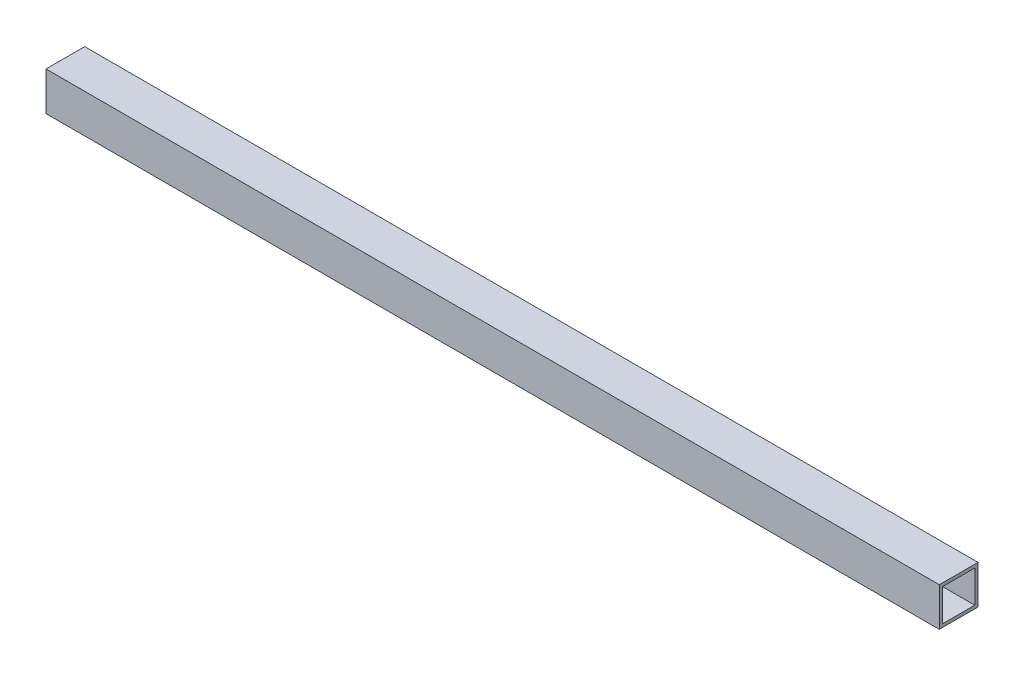
ISO-10303-21;
HEADER;
FILE_DESCRIPTION(('STEP AP214'),'2;1');
FILE_NAME('part.step','',(''),(''),'','','');
FILE_SCHEMA(('AUTOMOTIVE_DESIGN { 1 0 10303 214 1 1 1 1 }'));
ENDSEC;
DATA;
#1=APPLICATION_CONTEXT('core data for automotive mechanical design processes');
#2=APPLICATION_PROTOCOL_DEFINITION('international standard','automotive_design',2000,#1);
#3=PRODUCT_CONTEXT('',#1,'mechanical');
#4=PRODUCT('Part','Part','',(#3));
#5=PRODUCT_RELATED_PRODUCT_CATEGORY('part','',(#4));
#6=PRODUCT_DEFINITION_FORMATION('','',#4);
#7=PRODUCT_DEFINITION_CONTEXT('part definition',#1,'design');
#8=PRODUCT_DEFINITION('design','',#6,#7);
#9=PRODUCT_DEFINITION_SHAPE('','',#8);
#10=(LENGTH_UNIT() NAMED_UNIT(*) SI_UNIT(.MILLI.,.METRE.));
#11=(NAMED_UNIT(*) PLANE_ANGLE_UNIT() SI_UNIT($,.RADIAN.));
#12=(NAMED_UNIT(*) SI_UNIT($,.STERADIAN.) SOLID_ANGLE_UNIT());
#13=UNCERTAINTY_MEASURE_WITH_UNIT(LENGTH_MEASURE(1.E-05),#10,'distance_accuracy_value','');
#14=(GEOMETRIC_REPRESENTATION_CONTEXT(3) GLOBAL_UNCERTAINTY_ASSIGNED_CONTEXT((#13)) GLOBAL_UNIT_ASSIGNED_CONTEXT((#10,
#11,#12)) REPRESENTATION_CONTEXT('',''));
#15=CARTESIAN_POINT('',(0.,0.,0.));
#16=DIRECTION('',(0.,0.,1.));
#17=DIRECTION('',(1.,0.,0.));
#18=AXIS2_PLACEMENT_3D('',#15,#16,#17);
#19=CARTESIAN_POINT('',(440.,0.,0.));
#20=DIRECTION('',(-1.,0.,0.));
#21=DIRECTION('',(0.,0.,1.));
#22=AXIS2_PLACEMENT_3D('',#19,#20,#21);
#23=PLANE('',#22);
#24=DIRECTION('',(0.,1.,0.));
#25=VECTOR('',#24,1.);
#26=CARTESIAN_POINT('',(440.,9.525,-9.525));
#27=LINE('',#26,#25);
#28=CARTESIAN_POINT('',(440.,-9.525,-9.525));
#29=VERTEX_POINT('',#28);
#30=CARTESIAN_POINT('',(440.,9.525,-9.525));
#31=VERTEX_POINT('',#30);
#32=EDGE_CURVE('E153',#29,#31,#27,.T.);
#33=ORIENTED_EDGE('',*,*,#32,.T.);
#34=DIRECTION('',(0.,0.,1.));
#35=VECTOR('',#34,1.);
#36=CARTESIAN_POINT('',(440.,9.525,-9.525));
#37=LINE('',#36,#35);
#38=CARTESIAN_POINT('',(440.,9.525,9.525));
#39=VERTEX_POINT('',#38);
#40=EDGE_CURVE('E157',#31,#39,#37,.T.);
#41=ORIENTED_EDGE('',*,*,#40,.T.);
#42=DIRECTION('',(0.,-1.,0.));
#43=VECTOR('',#42,1.);
#44=CARTESIAN_POINT('',(440.,9.525,9.525));
#45=LINE('',#44,#43);
#46=CARTESIAN_POINT('',(440.,-9.525,9.525));
#47=VERTEX_POINT('',#46);
#48=EDGE_CURVE('E161',#39,#47,#45,.T.);
#49=ORIENTED_EDGE('',*,*,#48,.T.);
#50=DIRECTION('',(0.,0.,-1.));
#51=VECTOR('',#50,1.);
#52=CARTESIAN_POINT('',(440.,-9.525,-9.525));
#53=LINE('',#52,#51);
#54=EDGE_CURVE('E164',#47,#29,#53,.T.);
#55=ORIENTED_EDGE('',*,*,#54,.T.);
#56=EDGE_LOOP('',(#33,#41,#49,#55));
#57=FACE_BOUND('',#56,.T.);
#58=DIRECTION('',(0.,0.,-1.));
#59=VECTOR('',#58,1.);
#60=CARTESIAN_POINT('',(440.,-7.93750000000002,-7.93750000000001));
#61=LINE('',#60,#59);
#62=CARTESIAN_POINT('',(440.,-7.93750000000002,7.93750000000002));
#63=VERTEX_POINT('',#62);
#64=CARTESIAN_POINT('',(440.,-7.93750000000002,-7.93750000000001));
#65=VERTEX_POINT('',#64);
#66=EDGE_CURVE('E105',#63,#65,#61,.T.);
#67=ORIENTED_EDGE('',*,*,#66,.F.);
#68=DIRECTION('',(0.,-1.,0.));
#69=VECTOR('',#68,1.);
#70=CARTESIAN_POINT('',(440.,-7.93750000000002,7.93750000000002));
#71=LINE('',#70,#69);
#72=CARTESIAN_POINT('',(440.,7.9375,7.93750000000002));
#73=VERTEX_POINT('',#72);
#74=EDGE_CURVE('E131',#73,#63,#71,.T.);
#75=ORIENTED_EDGE('',*,*,#74,.F.);
#76=DIRECTION('',(0.,0.,1.));
#77=VECTOR('',#76,1.);
#78=CARTESIAN_POINT('',(440.,7.9375,-7.93750000000001));
#79=LINE('',#78,#77);
#80=CARTESIAN_POINT('',(440.,7.9375,-7.93750000000001));
#81=VERTEX_POINT('',#80);
#82=EDGE_CURVE('E127',#81,#73,#79,.T.);
#83=ORIENTED_EDGE('',*,*,#82,.F.);
#84=DIRECTION('',(0.,1.,0.));
#85=VECTOR('',#84,1.);
#86=CARTESIAN_POINT('',(440.,-7.93750000000002,-7.93750000000001));
#87=LINE('',#86,#85);
#88=EDGE_CURVE('E114',#65,#81,#87,.T.);
#89=ORIENTED_EDGE('',*,*,#88,.F.);
#90=EDGE_LOOP('',(#67,#75,#83,#89));
#91=FACE_BOUND('',#90,.T.);
#92=ADVANCED_FACE('F39',(#57,#91),#23,.F.);
#93=CARTESIAN_POINT('',(0.,0.,0.));
#94=DIRECTION('',(-1.,0.,0.));
#95=DIRECTION('',(0.,0.,1.));
#96=AXIS2_PLACEMENT_3D('',#93,#94,#95);
#97=PLANE('',#96);
#98=DIRECTION('',(0.,1.,0.));
#99=VECTOR('',#98,1.);
#100=CARTESIAN_POINT('',(0.,9.525,-9.525));
#101=LINE('',#100,#99);
#102=CARTESIAN_POINT('',(0.,-9.525,-9.525));
#103=VERTEX_POINT('',#102);
#104=CARTESIAN_POINT('',(0.,9.525,-9.525));
#105=VERTEX_POINT('',#104);
#106=EDGE_CURVE('E123',#103,#105,#101,.T.);
#107=ORIENTED_EDGE('',*,*,#106,.F.);
#108=DIRECTION('',(0.,0.,-1.));
#109=VECTOR('',#108,1.);
#110=CARTESIAN_POINT('',(0.,-9.525,-9.525));
#111=LINE('',#110,#109);
#112=CARTESIAN_POINT('',(0.,-9.525,9.525));
#113=VERTEX_POINT('',#112);
#114=EDGE_CURVE('E158',#113,#103,#111,.T.);
#115=ORIENTED_EDGE('',*,*,#114,.F.);
#116=DIRECTION('',(0.,-1.,0.));
#117=VECTOR('',#116,1.);
#118=CARTESIAN_POINT('',(0.,9.525,9.525));
#119=LINE('',#118,#117);
#120=CARTESIAN_POINT('',(0.,9.525,9.525));
#121=VERTEX_POINT('',#120);
#122=EDGE_CURVE('E174',#121,#113,#119,.T.);
#123=ORIENTED_EDGE('',*,*,#122,.F.);
#124=DIRECTION('',(0.,0.,1.));
#125=VECTOR('',#124,1.);
#126=CARTESIAN_POINT('',(0.,9.525,-9.525));
#127=LINE('',#126,#125);
#128=EDGE_CURVE('E171',#105,#121,#127,.T.);
#129=ORIENTED_EDGE('',*,*,#128,.F.);
#130=EDGE_LOOP('',(#107,#115,#123,#129));
#131=FACE_BOUND('',#130,.T.);
#132=DIRECTION('',(0.,-1.,0.));
#133=VECTOR('',#132,1.);
#134=CARTESIAN_POINT('',(0.,-7.93750000000002,7.93750000000002));
#135=LINE('',#134,#133);
#136=CARTESIAN_POINT('',(0.,7.9375,7.93750000000002));
#137=VERTEX_POINT('',#136);
#138=CARTESIAN_POINT('',(0.,-7.93750000000002,7.93750000000002));
#139=VERTEX_POINT('',#138);
#140=EDGE_CURVE('E115',#137,#139,#135,.T.);
#141=ORIENTED_EDGE('',*,*,#140,.T.);
#142=DIRECTION('',(0.,0.,-1.));
#143=VECTOR('',#142,1.);
#144=CARTESIAN_POINT('',(0.,-7.93750000000002,-7.93750000000001));
#145=LINE('',#144,#143);
#146=CARTESIAN_POINT('',(0.,-7.93750000000002,-7.93750000000001));
#147=VERTEX_POINT('',#146);
#148=EDGE_CURVE('E63',#139,#147,#145,.T.);
#149=ORIENTED_EDGE('',*,*,#148,.T.);
#150=DIRECTION('',(0.,1.,0.));
#151=VECTOR('',#150,1.);
#152=CARTESIAN_POINT('',(0.,-7.93750000000002,-7.93750000000001));
#153=LINE('',#152,#151);
#154=CARTESIAN_POINT('',(0.,7.9375,-7.93750000000001));
#155=VERTEX_POINT('',#154);
#156=EDGE_CURVE('E121',#147,#155,#153,.T.);
#157=ORIENTED_EDGE('',*,*,#156,.T.);
#158=DIRECTION('',(0.,0.,1.));
#159=VECTOR('',#158,1.);
#160=CARTESIAN_POINT('',(0.,7.9375,-7.93750000000001));
#161=LINE('',#160,#159);
#162=EDGE_CURVE('E140',#155,#137,#161,.T.);
#163=ORIENTED_EDGE('',*,*,#162,.T.);
#164=EDGE_LOOP('',(#141,#149,#157,#163));
#165=FACE_BOUND('',#164,.T.);
#166=ADVANCED_FACE('F197',(#131,#165),#97,.T.);
#167=CARTESIAN_POINT('',(440.,9.525,-9.525));
#168=DIRECTION('',(0.,0.,1.));
#169=DIRECTION('',(0.,-1.,0.));
#170=AXIS2_PLACEMENT_3D('',#167,#168,#169);
#171=PLANE('',#170);
#172=ORIENTED_EDGE('',*,*,#106,.T.);
#173=DIRECTION('',(-1.,0.,0.));
#174=VECTOR('',#173,1.);
#175=CARTESIAN_POINT('',(440.,9.525,-9.525));
#176=LINE('',#175,#174);
#177=EDGE_CURVE('E11',#31,#105,#176,.T.);
#178=ORIENTED_EDGE('',*,*,#177,.F.);
#179=ORIENTED_EDGE('',*,*,#32,.F.);
#180=DIRECTION('',(-1.,0.,0.));
#181=VECTOR('',#180,1.);
#182=CARTESIAN_POINT('',(440.,-9.525,-9.525));
#183=LINE('',#182,#181);
#184=EDGE_CURVE('E167',#29,#103,#183,.T.);
#185=ORIENTED_EDGE('',*,*,#184,.T.);
#186=EDGE_LOOP('',(#172,#178,#179,#185));
#187=FACE_BOUND('',#186,.T.);
#188=ADVANCED_FACE('F41',(#187),#171,.F.);
#189=CARTESIAN_POINT('',(440.,9.525,-9.525));
#190=DIRECTION('',(0.,-1.,0.));
#191=DIRECTION('',(0.,0.,-1.));
#192=AXIS2_PLACEMENT_3D('',#189,#190,#191);
#193=PLANE('',#192);
#194=ORIENTED_EDGE('',*,*,#128,.T.);
#195=DIRECTION('',(-1.,0.,0.));
#196=VECTOR('',#195,1.);
#197=CARTESIAN_POINT('',(440.,9.525,9.525));
#198=LINE('',#197,#196);
#199=EDGE_CURVE('E48',#39,#121,#198,.T.);
#200=ORIENTED_EDGE('',*,*,#199,.F.);
#201=ORIENTED_EDGE('',*,*,#40,.F.);
#202=ORIENTED_EDGE('',*,*,#177,.T.);
#203=EDGE_LOOP('',(#194,#200,#201,#202));
#204=FACE_BOUND('',#203,.T.);
#205=ADVANCED_FACE('F207',(#204),#193,.F.);
#206=CARTESIAN_POINT('',(440.,9.525,9.525));
#207=DIRECTION('',(0.,0.,-1.));
#208=DIRECTION('',(0.,1.,0.));
#209=AXIS2_PLACEMENT_3D('',#206,#207,#208);
#210=PLANE('',#209);
#211=ORIENTED_EDGE('',*,*,#122,.T.);
#212=DIRECTION('',(-1.,0.,0.));
#213=VECTOR('',#212,1.);
#214=CARTESIAN_POINT('',(440.,-9.525,9.525));
#215=LINE('',#214,#213);
#216=EDGE_CURVE('E182',#47,#113,#215,.T.);
#217=ORIENTED_EDGE('',*,*,#216,.F.);
#218=ORIENTED_EDGE('',*,*,#48,.F.);
#219=ORIENTED_EDGE('',*,*,#199,.T.);
#220=EDGE_LOOP('',(#211,#217,#218,#219));
#221=FACE_BOUND('',#220,.T.);
#222=ADVANCED_FACE('F191',(#221),#210,.F.);
#223=CARTESIAN_POINT('',(440.,-9.525,-9.525));
#224=DIRECTION('',(0.,1.,0.));
#225=DIRECTION('',(0.,0.,1.));
#226=AXIS2_PLACEMENT_3D('',#223,#224,#225);
#227=PLANE('',#226);
#228=ORIENTED_EDGE('',*,*,#114,.T.);
#229=ORIENTED_EDGE('',*,*,#184,.F.);
#230=ORIENTED_EDGE('',*,*,#54,.F.);
#231=ORIENTED_EDGE('',*,*,#216,.T.);
#232=EDGE_LOOP('',(#228,#229,#230,#231));
#233=FACE_BOUND('',#232,.T.);
#234=ADVANCED_FACE('F201',(#233),#227,.F.);
#235=CARTESIAN_POINT('',(440.,-7.93750000000002,-7.93750000000001));
#236=DIRECTION('',(0.,1.,0.));
#237=DIRECTION('',(0.,0.,1.));
#238=AXIS2_PLACEMENT_3D('',#235,#236,#237);
#239=PLANE('',#238);
#240=ORIENTED_EDGE('',*,*,#148,.F.);
#241=DIRECTION('',(-1.,0.,0.));
#242=VECTOR('',#241,1.);
#243=CARTESIAN_POINT('',(440.,-7.93750000000002,7.93750000000002));
#244=LINE('',#243,#242);
#245=EDGE_CURVE('E109',#63,#139,#244,.T.);
#246=ORIENTED_EDGE('',*,*,#245,.F.);
#247=ORIENTED_EDGE('',*,*,#66,.T.);
#248=DIRECTION('',(-1.,0.,0.));
#249=VECTOR('',#248,1.);
#250=CARTESIAN_POINT('',(440.,-7.93750000000002,-7.93750000000001));
#251=LINE('',#250,#249);
#252=EDGE_CURVE('E108',#65,#147,#251,.T.);
#253=ORIENTED_EDGE('',*,*,#252,.T.);
#254=EDGE_LOOP('',(#240,#246,#247,#253));
#255=FACE_BOUND('',#254,.T.);
#256=ADVANCED_FACE('F107',(#255),#239,.T.);
#257=CARTESIAN_POINT('',(440.,-7.93750000000002,-7.93750000000001));
#258=DIRECTION('',(0.,0.,1.));
#259=DIRECTION('',(1.,0.,0.));
#260=AXIS2_PLACEMENT_3D('',#257,#258,#259);
#261=PLANE('',#260);
#262=ORIENTED_EDGE('',*,*,#156,.F.);
#263=ORIENTED_EDGE('',*,*,#252,.F.);
#264=ORIENTED_EDGE('',*,*,#88,.T.);
#265=DIRECTION('',(-1.,0.,0.));
#266=VECTOR('',#265,1.);
#267=CARTESIAN_POINT('',(440.,7.9375,-7.93750000000001));
#268=LINE('',#267,#266);
#269=EDGE_CURVE('E124',#81,#155,#268,.T.);
#270=ORIENTED_EDGE('',*,*,#269,.T.);
#271=EDGE_LOOP('',(#262,#263,#264,#270));
#272=FACE_BOUND('',#271,.T.);
#273=ADVANCED_FACE('F118',(#272),#261,.T.);
#274=CARTESIAN_POINT('',(440.,7.9375,-7.93750000000001));
#275=DIRECTION('',(0.,-1.,0.));
#276=DIRECTION('',(0.,0.,-1.));
#277=AXIS2_PLACEMENT_3D('',#274,#275,#276);
#278=PLANE('',#277);
#279=ORIENTED_EDGE('',*,*,#162,.F.);
#280=ORIENTED_EDGE('',*,*,#269,.F.);
#281=ORIENTED_EDGE('',*,*,#82,.T.);
#282=DIRECTION('',(-1.,0.,0.));
#283=VECTOR('',#282,1.);
#284=CARTESIAN_POINT('',(440.,7.9375,7.93750000000002));
#285=LINE('',#284,#283);
#286=EDGE_CURVE('E55',#73,#137,#285,.T.);
#287=ORIENTED_EDGE('',*,*,#286,.T.);
#288=EDGE_LOOP('',(#279,#280,#281,#287));
#289=FACE_BOUND('',#288,.T.);
#290=ADVANCED_FACE('F230',(#289),#278,.T.);
#291=CARTESIAN_POINT('',(440.,-7.93750000000002,7.93750000000002));
#292=DIRECTION('',(0.,0.,-1.));
#293=DIRECTION('',(-1.,0.,0.));
#294=AXIS2_PLACEMENT_3D('',#291,#292,#293);
#295=PLANE('',#294);
#296=ORIENTED_EDGE('',*,*,#140,.F.);
#297=ORIENTED_EDGE('',*,*,#286,.F.);
#298=ORIENTED_EDGE('',*,*,#74,.T.);
#299=ORIENTED_EDGE('',*,*,#245,.T.);
#300=EDGE_LOOP('',(#296,#297,#298,#299));
#301=FACE_BOUND('',#300,.T.);
#302=ADVANCED_FACE('F234',(#301),#295,.T.);
#303=CLOSED_SHELL('',(#92,#166,#188,#205,#222,#234,#256,#273,#290,#302));
#304=MANIFOLD_SOLID_BREP('B2',#303);
#305=ADVANCED_BREP_SHAPE_REPRESENTATION('',(#18,#304),#14);
#306=SHAPE_DEFINITION_REPRESENTATION(#9,#305);
ENDSEC;
END-ISO-10303-21;
